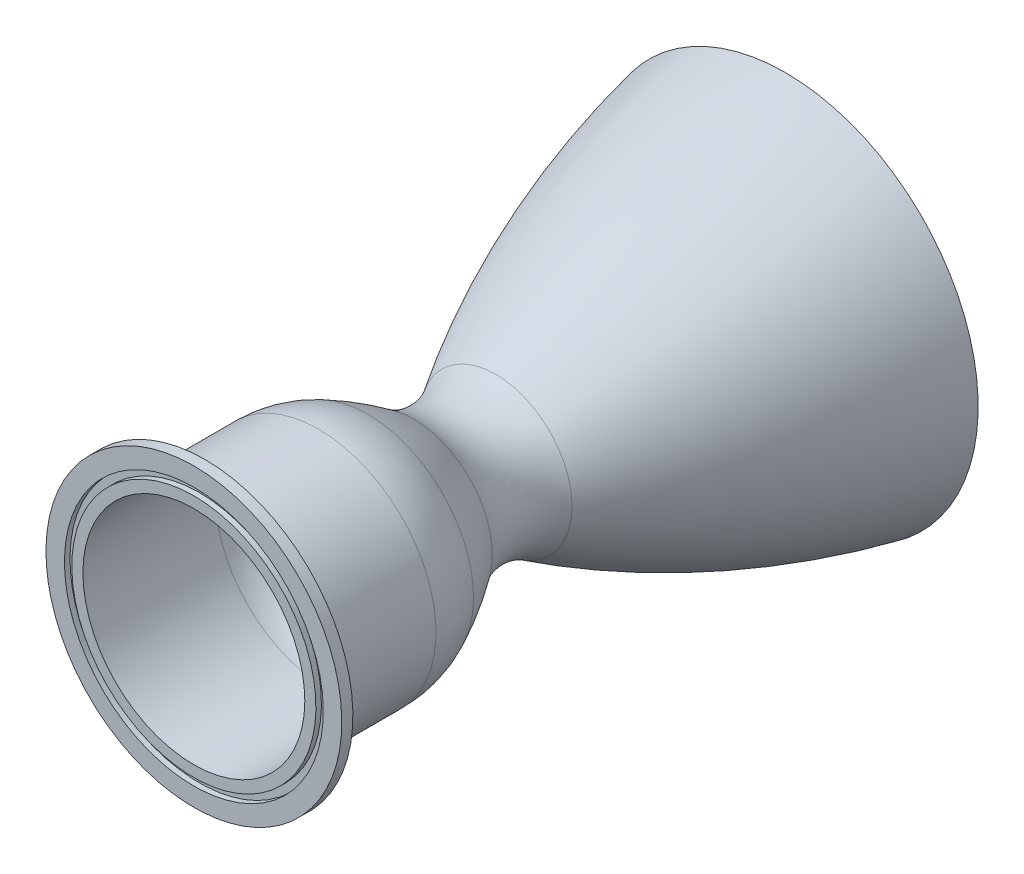
ISO-10303-21;
HEADER;
FILE_DESCRIPTION(('STEP AP214'),'2;1');
FILE_NAME('part.step','',(''),(''),'','','');
FILE_SCHEMA(('AUTOMOTIVE_DESIGN { 1 0 10303 214 1 1 1 1 }'));
ENDSEC;
DATA;
#1=APPLICATION_CONTEXT('core data for automotive mechanical design processes');
#2=APPLICATION_PROTOCOL_DEFINITION('international standard','automotive_design',2000,#1);
#3=PRODUCT_CONTEXT('',#1,'mechanical');
#4=PRODUCT('Part','Part','',(#3));
#5=PRODUCT_RELATED_PRODUCT_CATEGORY('part','',(#4));
#6=PRODUCT_DEFINITION_FORMATION('','',#4);
#7=PRODUCT_DEFINITION_CONTEXT('part definition',#1,'design');
#8=PRODUCT_DEFINITION('design','',#6,#7);
#9=PRODUCT_DEFINITION_SHAPE('','',#8);
#10=(LENGTH_UNIT() NAMED_UNIT(*) SI_UNIT(.MILLI.,.METRE.));
#11=(NAMED_UNIT(*) PLANE_ANGLE_UNIT() SI_UNIT($,.RADIAN.));
#12=(NAMED_UNIT(*) SI_UNIT($,.STERADIAN.) SOLID_ANGLE_UNIT());
#13=UNCERTAINTY_MEASURE_WITH_UNIT(LENGTH_MEASURE(1.E-05),#10,'distance_accuracy_value','');
#14=(GEOMETRIC_REPRESENTATION_CONTEXT(3) GLOBAL_UNCERTAINTY_ASSIGNED_CONTEXT((#13)) GLOBAL_UNIT_ASSIGNED_CONTEXT((#10,
#11,#12)) REPRESENTATION_CONTEXT('',''));
#15=CARTESIAN_POINT('',(0.,0.,0.));
#16=DIRECTION('',(0.,0.,1.));
#17=DIRECTION('',(1.,0.,0.));
#18=AXIS2_PLACEMENT_3D('',#15,#16,#17);
#19=CARTESIAN_POINT('',(0.,51.0189205304801,-160.));
#20=DIRECTION('',(0.,0.,-1.));
#21=DIRECTION('',(-1.,0.,0.));
#22=AXIS2_PLACEMENT_3D('',#19,#20,#21);
#23=PLANE('',#22);
#24=CARTESIAN_POINT('',(0.,0.,-160.));
#25=DIRECTION('',(0.,0.,-1.));
#26=DIRECTION('',(1.,0.,0.));
#27=AXIS2_PLACEMENT_3D('',#24,#25,#26);
#28=CIRCLE('',#27,51.0189205304801);
#29=CARTESIAN_POINT('',(0.,51.0189205304801,-160.));
#30=VERTEX_POINT('',#29);
#31=EDGE_CURVE('E121',#30,#30,#28,.T.);
#32=ORIENTED_EDGE('',*,*,#31,.F.);
#33=EDGE_LOOP('',(#32));
#34=FACE_BOUND('',#33,.T.);
#35=CARTESIAN_POINT('',(0.,0.,-160.));
#36=DIRECTION('',(0.,0.,-1.));
#37=DIRECTION('',(1.,0.,0.));
#38=AXIS2_PLACEMENT_3D('',#35,#36,#37);
#39=CIRCLE('',#38,52.1415043281534);
#40=CARTESIAN_POINT('',(0.,52.1415043281534,-160.));
#41=VERTEX_POINT('',#40);
#42=EDGE_CURVE('E129',#41,#41,#39,.T.);
#43=ORIENTED_EDGE('',*,*,#42,.T.);
#44=EDGE_LOOP('',(#43));
#45=FACE_BOUND('',#44,.T.);
#46=ADVANCED_FACE('F44',(#34,#45),#23,.T.);
#47=CARTESIAN_POINT('',(0.,31.75,-3.));
#48=DIRECTION('',(0.,0.,-1.));
#49=DIRECTION('',(-1.,0.,0.));
#50=AXIS2_PLACEMENT_3D('',#47,#48,#49);
#51=PLANE('',#50);
#52=CARTESIAN_POINT('',(0.,0.,-3.));
#53=DIRECTION('',(0.,0.,-1.));
#54=DIRECTION('',(1.,0.,0.));
#55=AXIS2_PLACEMENT_3D('',#52,#53,#54);
#56=CIRCLE('',#55,31.75);
#57=CARTESIAN_POINT('',(0.,31.75,-3.));
#58=VERTEX_POINT('',#57);
#59=EDGE_CURVE('E133',#58,#58,#56,.T.);
#60=ORIENTED_EDGE('',*,*,#59,.F.);
#61=EDGE_LOOP('',(#60));
#62=FACE_BOUND('',#61,.T.);
#63=CARTESIAN_POINT('',(0.,0.,-3.));
#64=DIRECTION('',(0.,0.,-1.));
#65=DIRECTION('',(1.,0.,0.));
#66=AXIS2_PLACEMENT_3D('',#63,#64,#65);
#67=CIRCLE('',#66,40.0084847717904);
#68=CARTESIAN_POINT('',(0.,40.0084847717904,-3.));
#69=VERTEX_POINT('',#68);
#70=EDGE_CURVE('E11',#69,#69,#67,.T.);
#71=ORIENTED_EDGE('',*,*,#70,.T.);
#72=EDGE_LOOP('',(#71));
#73=FACE_BOUND('',#72,.T.);
#74=ADVANCED_FACE('F162',(#62,#73),#51,.T.);
#75=CARTESIAN_POINT('',(0.,0.,-1.5));
#76=DIRECTION('',(0.,0.,-1.));
#77=DIRECTION('',(0.,1.,0.));
#78=AXIS2_PLACEMENT_3D('',#75,#76,#77);
#79=CYLINDRICAL_SURFACE('',#78,40.0084847717904);
#80=CARTESIAN_POINT('',(0.,0.,0.));
#81=DIRECTION('',(0.,0.,-1.));
#82=DIRECTION('',(1.,0.,0.));
#83=AXIS2_PLACEMENT_3D('',#80,#81,#82);
#84=CIRCLE('',#83,40.0084847717904);
#85=CARTESIAN_POINT('',(0.,40.0084847717904,0.));
#86=VERTEX_POINT('',#85);
#87=EDGE_CURVE('E51',#86,#86,#84,.T.);
#88=ORIENTED_EDGE('',*,*,#87,.T.);
#89=EDGE_LOOP('',(#88));
#90=FACE_BOUND('',#89,.T.);
#91=ORIENTED_EDGE('',*,*,#70,.F.);
#92=EDGE_LOOP('',(#91));
#93=FACE_BOUND('',#92,.T.);
#94=ADVANCED_FACE('F159',(#90,#93),#79,.T.);
#95=CARTESIAN_POINT('',(0.,40.0084847717904,0.));
#96=DIRECTION('',(0.,0.,1.));
#97=DIRECTION('',(1.,0.,0.));
#98=AXIS2_PLACEMENT_3D('',#95,#96,#97);
#99=PLANE('',#98);
#100=CARTESIAN_POINT('',(0.,0.,0.));
#101=DIRECTION('',(0.,0.,-1.));
#102=DIRECTION('',(1.,0.,0.));
#103=AXIS2_PLACEMENT_3D('',#100,#101,#102);
#104=CIRCLE('',#103,35.0084847717904);
#105=CARTESIAN_POINT('',(0.,35.0084847717904,0.));
#106=VERTEX_POINT('',#105);
#107=EDGE_CURVE('E141',#106,#106,#104,.T.);
#108=ORIENTED_EDGE('',*,*,#107,.T.);
#109=EDGE_LOOP('',(#108));
#110=FACE_BOUND('',#109,.T.);
#111=ORIENTED_EDGE('',*,*,#87,.F.);
#112=EDGE_LOOP('',(#111));
#113=FACE_BOUND('',#112,.T.);
#114=ADVANCED_FACE('F144',(#110,#113),#99,.T.);
#115=CARTESIAN_POINT('',(0.,0.,-0.75));
#116=DIRECTION('',(0.,0.,1.));
#117=DIRECTION('',(0.,1.,0.));
#118=AXIS2_PLACEMENT_3D('',#115,#116,#117);
#119=CYLINDRICAL_SURFACE('',#118,35.0084847717904);
#120=CARTESIAN_POINT('',(0.,0.,-1.5));
#121=DIRECTION('',(0.,0.,-1.));
#122=DIRECTION('',(1.,0.,0.));
#123=AXIS2_PLACEMENT_3D('',#120,#121,#122);
#124=CIRCLE('',#123,35.0084847717904);
#125=CARTESIAN_POINT('',(0.,35.0084847717904,-1.5));
#126=VERTEX_POINT('',#125);
#127=EDGE_CURVE('E139',#126,#126,#124,.T.);
#128=ORIENTED_EDGE('',*,*,#127,.T.);
#129=EDGE_LOOP('',(#128));
#130=FACE_BOUND('',#129,.T.);
#131=ORIENTED_EDGE('',*,*,#107,.F.);
#132=EDGE_LOOP('',(#131));
#133=FACE_BOUND('',#132,.T.);
#134=ADVANCED_FACE('F147',(#130,#133),#119,.F.);
#135=CARTESIAN_POINT('',(0.,35.0084847717904,-1.5));
#136=DIRECTION('',(0.,0.,1.));
#137=DIRECTION('',(1.,0.,0.));
#138=AXIS2_PLACEMENT_3D('',#135,#136,#137);
#139=PLANE('',#138);
#140=CARTESIAN_POINT('',(0.,0.,-1.5));
#141=DIRECTION('',(0.,0.,-1.));
#142=DIRECTION('',(1.,0.,0.));
#143=AXIS2_PLACEMENT_3D('',#140,#141,#142);
#144=CIRCLE('',#143,33.0084847717904);
#145=CARTESIAN_POINT('',(0.,33.0084847717904,-1.5));
#146=VERTEX_POINT('',#145);
#147=EDGE_CURVE('E137',#146,#146,#144,.T.);
#148=ORIENTED_EDGE('',*,*,#147,.T.);
#149=EDGE_LOOP('',(#148));
#150=FACE_BOUND('',#149,.T.);
#151=ORIENTED_EDGE('',*,*,#127,.F.);
#152=EDGE_LOOP('',(#151));
#153=FACE_BOUND('',#152,.T.);
#154=ADVANCED_FACE('F149',(#150,#153),#139,.T.);
#155=CARTESIAN_POINT('',(0.,0.,-0.75));
#156=DIRECTION('',(0.,0.,-1.));
#157=DIRECTION('',(0.,1.,0.));
#158=AXIS2_PLACEMENT_3D('',#155,#156,#157);
#159=CYLINDRICAL_SURFACE('',#158,33.0084847717904);
#160=CARTESIAN_POINT('',(0.,0.,0.));
#161=DIRECTION('',(0.,0.,-1.));
#162=DIRECTION('',(1.,0.,0.));
#163=AXIS2_PLACEMENT_3D('',#160,#161,#162);
#164=CIRCLE('',#163,33.0084847717904);
#165=CARTESIAN_POINT('',(0.,33.0084847717904,0.));
#166=VERTEX_POINT('',#165);
#167=EDGE_CURVE('E135',#166,#166,#164,.T.);
#168=ORIENTED_EDGE('',*,*,#167,.T.);
#169=EDGE_LOOP('',(#168));
#170=FACE_BOUND('',#169,.T.);
#171=ORIENTED_EDGE('',*,*,#147,.F.);
#172=EDGE_LOOP('',(#171));
#173=FACE_BOUND('',#172,.T.);
#174=ADVANCED_FACE('F156',(#170,#173),#159,.T.);
#175=CARTESIAN_POINT('',(0.,33.0084847717904,0.));
#176=DIRECTION('',(0.,0.,1.));
#177=DIRECTION('',(1.,0.,0.));
#178=AXIS2_PLACEMENT_3D('',#175,#176,#177);
#179=PLANE('',#178);
#180=CARTESIAN_POINT('',(0.,0.,0.));
#181=DIRECTION('',(0.,0.,-1.));
#182=DIRECTION('',(1.,0.,0.));
#183=AXIS2_PLACEMENT_3D('',#180,#181,#182);
#184=CIRCLE('',#183,30.0084847717904);
#185=CARTESIAN_POINT('',(0.,30.0084847717904,0.));
#186=VERTEX_POINT('',#185);
#187=EDGE_CURVE('E117',#186,#186,#184,.T.);
#188=ORIENTED_EDGE('',*,*,#187,.T.);
#189=EDGE_LOOP('',(#188));
#190=FACE_BOUND('',#189,.T.);
#191=ORIENTED_EDGE('',*,*,#167,.F.);
#192=EDGE_LOOP('',(#191));
#193=FACE_BOUND('',#192,.T.);
#194=ADVANCED_FACE('F193',(#190,#193),#179,.T.);
#195=CARTESIAN_POINT('',(0.,0.,-21.5));
#196=DIRECTION('',(0.,0.,-1.));
#197=DIRECTION('',(0.,1.,0.));
#198=AXIS2_PLACEMENT_3D('',#195,#196,#197);
#199=CYLINDRICAL_SURFACE('',#198,31.75);
#200=CARTESIAN_POINT('',(0.,0.,-33.7351958082016));
#201=DIRECTION('',(0.,0.,-1.));
#202=DIRECTION('',(0.,-1.,0.));
#203=AXIS2_PLACEMENT_3D('',#200,#201,#202);
#204=CIRCLE('',#203,31.75);
#205=CARTESIAN_POINT('',(0.,31.75,-33.7351958082016));
#206=VERTEX_POINT('',#205);
#207=EDGE_CURVE('E131',#206,#206,#204,.T.);
#208=ORIENTED_EDGE('',*,*,#207,.F.);
#209=EDGE_LOOP('',(#208));
#210=FACE_BOUND('',#209,.T.);
#211=ORIENTED_EDGE('',*,*,#59,.T.);
#212=EDGE_LOOP('',(#211));
#213=FACE_BOUND('',#212,.T.);
#214=ADVANCED_FACE('F185',(#210,#213),#199,.T.);
#215=CARTESIAN_POINT('',(0.,0.,-33.7351958082016));
#216=DIRECTION('',(0.,0.,-1.));
#217=DIRECTION('',(-1.,0.,0.));
#218=AXIS2_PLACEMENT_3D('',#215,#216,#217);
#219=DEGENERATE_TOROIDAL_SURFACE('',#218,1.75,30.,.T.);
#220=CARTESIAN_POINT('',(0.,0.,-46.9815567864602));
#221=DIRECTION('',(0.,0.,1.));
#222=DIRECTION('',(0.,-1.,0.));
#223=AXIS2_PLACEMENT_3D('',#220,#221,#222);
#224=CIRCLE('',#223,28.6671677713995);
#225=CARTESIAN_POINT('',(0.,28.6671677713995,-46.9815567864602));
#226=VERTEX_POINT('',#225);
#227=EDGE_CURVE('E127',#226,#226,#224,.T.);
#228=ORIENTED_EDGE('',*,*,#227,.T.);
#229=EDGE_LOOP('',(#228));
#230=FACE_BOUND('',#229,.T.);
#231=ORIENTED_EDGE('',*,*,#207,.T.);
#232=EDGE_LOOP('',(#231));
#233=FACE_BOUND('',#232,.T.);
#234=ADVANCED_FACE('F175',(#230,#233),#219,.T.);
#235=CARTESIAN_POINT('',(0.,0.,-208.671046048929));
#236=DIRECTION('',(0.,0.,-1.));
#237=DIRECTION('',(-1.,0.,0.));
#238=AXIS2_PLACEMENT_3D('',#235,#236,#237);
#239=DEGENERATE_TOROIDAL_SURFACE('',#238,181.851147330347,239.000903248655,.F.);
#240=CARTESIAN_POINT('',(0.,0.,-81.6684638668013));
#241=DIRECTION('',(0.,0.,1.));
#242=DIRECTION('',(0.,-1.,0.));
#243=AXIS2_PLACEMENT_3D('',#240,#241,#242);
#244=CIRCLE('',#243,20.6131109295868);
#245=CARTESIAN_POINT('',(0.,20.6131109295868,-81.6684638668013));
#246=VERTEX_POINT('',#245);
#247=EDGE_CURVE('E125',#246,#246,#244,.T.);
#248=ORIENTED_EDGE('',*,*,#247,.F.);
#249=EDGE_LOOP('',(#248));
#250=FACE_BOUND('',#249,.T.);
#251=ORIENTED_EDGE('',*,*,#42,.F.);
#252=EDGE_LOOP('',(#251));
#253=FACE_BOUND('',#252,.T.);
#254=ADVANCED_FACE('F172',(#250,#253),#239,.F.);
#255=CARTESIAN_POINT('',(0.,0.,-6.36998999925671));
#256=DIRECTION('',(0.,0.,-1.));
#257=DIRECTION('',(-1.,0.,0.));
#258=AXIS2_PLACEMENT_3D('',#255,#256,#257);
#259=DEGENERATE_TOROIDAL_SURFACE('',#258,53.8572597649441,91.9759778263472,.F.);
#260=CARTESIAN_POINT('',(0.,0.,-59.4898591960974));
#261=DIRECTION('',(0.,0.,-1.));
#262=DIRECTION('',(0.,-1.,0.));
#263=AXIS2_PLACEMENT_3D('',#260,#261,#262);
#264=CIRCLE('',#263,21.2284245804972);
#265=CARTESIAN_POINT('',(0.,21.2284245804972,-59.4898591960974));
#266=VERTEX_POINT('',#265);
#267=EDGE_CURVE('E123',#266,#266,#264,.T.);
#268=ORIENTED_EDGE('',*,*,#267,.F.);
#269=EDGE_LOOP('',(#268));
#270=FACE_BOUND('',#269,.T.);
#271=ORIENTED_EDGE('',*,*,#227,.F.);
#272=EDGE_LOOP('',(#271));
#273=FACE_BOUND('',#272,.T.);
#274=ADVANCED_FACE('F174',(#270,#273),#259,.F.);
#275=CARTESIAN_POINT('',(0.,0.,-71.040672887284));
#276=DIRECTION('',(0.,0.,1.));
#277=DIRECTION('',(-1.,0.,0.));
#278=AXIS2_PLACEMENT_3D('',#275,#276,#277);
#279=TOROIDAL_SURFACE('',#278,37.5556626528571,20.);
#280=ORIENTED_EDGE('',*,*,#247,.T.);
#281=EDGE_LOOP('',(#280));
#282=FACE_BOUND('',#281,.T.);
#283=ORIENTED_EDGE('',*,*,#267,.T.);
#284=EDGE_LOOP('',(#283));
#285=FACE_BOUND('',#284,.T.);
#286=ADVANCED_FACE('F182',(#282,#285),#279,.F.);
#287=CARTESIAN_POINT('',(0.,0.,-202.93944338944));
#288=DIRECTION('',(0.,0.,1.));
#289=DIRECTION('',(-1.,0.,0.));
#290=AXIS2_PLACEMENT_3D('',#287,#288,#289);
#291=DEGENERATE_TOROIDAL_SURFACE('',#290,162.439301006246,217.73426037309,.F.);
#292=CARTESIAN_POINT('',(0.,0.,-82.1790743869948));
#293=DIRECTION('',(0.,0.,-1.));
#294=DIRECTION('',(0.,-1.,0.));
#295=AXIS2_PLACEMENT_3D('',#292,#293,#294);
#296=CIRCLE('',#295,18.7377985913855);
#297=CARTESIAN_POINT('',(0.,18.7377985913855,-82.1790743869948));
#298=VERTEX_POINT('',#297);
#299=EDGE_CURVE('E119',#298,#298,#296,.T.);
#300=ORIENTED_EDGE('',*,*,#299,.F.);
#301=EDGE_LOOP('',(#300));
#302=FACE_BOUND('',#301,.T.);
#303=ORIENTED_EDGE('',*,*,#31,.T.);
#304=EDGE_LOOP('',(#303));
#305=FACE_BOUND('',#304,.T.);
#306=ADVANCED_FACE('F245',(#302,#305),#291,.T.);
#307=CARTESIAN_POINT('',(0.,0.,-71.0866198696835));
#308=DIRECTION('',(0.,0.,-1.));
#309=DIRECTION('',(-1.,0.,0.));
#310=AXIS2_PLACEMENT_3D('',#307,#308,#309);
#311=TOROIDAL_SURFACE('',#310,35.3798373120886,20.);
#312=CARTESIAN_POINT('',(0.,0.,-59.2662675053221));
#313=DIRECTION('',(0.,0.,1.));
#314=DIRECTION('',(0.,-1.,0.));
#315=AXIS2_PLACEMENT_3D('',#312,#313,#314);
#316=CIRCLE('',#315,19.2466643451136);
#317=CARTESIAN_POINT('',(0.,19.2466643451136,-59.2662675053221));
#318=VERTEX_POINT('',#317);
#319=EDGE_CURVE('E113',#318,#318,#316,.T.);
#320=ORIENTED_EDGE('',*,*,#319,.T.);
#321=EDGE_LOOP('',(#320));
#322=FACE_BOUND('',#321,.T.);
#323=ORIENTED_EDGE('',*,*,#299,.T.);
#324=EDGE_LOOP('',(#323));
#325=FACE_BOUND('',#324,.T.);
#326=ADVANCED_FACE('F255',(#322,#325),#311,.T.);
#327=CARTESIAN_POINT('',(0.,0.,-21.5));
#328=DIRECTION('',(0.,0.,1.));
#329=DIRECTION('',(0.,1.,0.));
#330=AXIS2_PLACEMENT_3D('',#327,#328,#329);
#331=CYLINDRICAL_SURFACE('',#330,30.0084847717904);
#332=CARTESIAN_POINT('',(0.,0.,-35.8298690040139));
#333=DIRECTION('',(0.,0.,1.));
#334=DIRECTION('',(0.,-1.,0.));
#335=AXIS2_PLACEMENT_3D('',#332,#333,#334);
#336=CIRCLE('',#335,30.0084847717904);
#337=CARTESIAN_POINT('',(0.,30.0084847717904,-35.8298690040139));
#338=VERTEX_POINT('',#337);
#339=EDGE_CURVE('E111',#338,#338,#336,.T.);
#340=ORIENTED_EDGE('',*,*,#339,.F.);
#341=EDGE_LOOP('',(#340));
#342=FACE_BOUND('',#341,.T.);
#343=ORIENTED_EDGE('',*,*,#187,.F.);
#344=EDGE_LOOP('',(#343));
#345=FACE_BOUND('',#344,.T.);
#346=ADVANCED_FACE('F266',(#342,#345),#331,.F.);
#347=CARTESIAN_POINT('',(0.,0.,-6.07468186569553));
#348=DIRECTION('',(0.,0.,1.));
#349=DIRECTION('',(-1.,0.,0.));
#350=AXIS2_PLACEMENT_3D('',#347,#348,#349);
#351=DEGENERATE_TOROIDAL_SURFACE('',#350,53.3526140062742,90.,.F.);
#352=CARTESIAN_POINT('',(0.,0.,-44.3313510435335));
#353=DIRECTION('',(0.,0.,-1.));
#354=DIRECTION('',(0.,-1.,0.));
#355=AXIS2_PLACEMENT_3D('',#352,#353,#354);
#356=CIRCLE('',#355,28.1116558512374);
#357=CARTESIAN_POINT('',(0.,28.1116558512374,-44.3313510435335));
#358=VERTEX_POINT('',#357);
#359=EDGE_CURVE('E108',#358,#358,#356,.T.);
#360=ORIENTED_EDGE('',*,*,#359,.F.);
#361=EDGE_LOOP('',(#360));
#362=FACE_BOUND('',#361,.T.);
#363=ORIENTED_EDGE('',*,*,#319,.F.);
#364=EDGE_LOOP('',(#363));
#365=FACE_BOUND('',#364,.T.);
#366=ADVANCED_FACE('F277',(#362,#365),#351,.T.);
#367=CARTESIAN_POINT('',(0.,0.,-35.8298690040139));
#368=DIRECTION('',(0.,0.,1.));
#369=DIRECTION('',(-1.,0.,0.));
#370=AXIS2_PLACEMENT_3D('',#367,#368,#369);
#371=DEGENERATE_TOROIDAL_SURFACE('',#370,10.0084847717904,20.,.T.);
#372=ORIENTED_EDGE('',*,*,#339,.T.);
#373=EDGE_LOOP('',(#372));
#374=FACE_BOUND('',#373,.T.);
#375=ORIENTED_EDGE('',*,*,#359,.T.);
#376=EDGE_LOOP('',(#375));
#377=FACE_BOUND('',#376,.T.);
#378=ADVANCED_FACE('F109',(#374,#377),#371,.F.);
#379=CLOSED_SHELL('',(#46,#74,#94,#114,#134,#154,#174,#194,#214,#234,#254,#274,#286,#306,#326,
#346,#366,#378));
#380=MANIFOLD_SOLID_BREP('B2',#379);
#381=ADVANCED_BREP_SHAPE_REPRESENTATION('',(#18,#380),#14);
#382=SHAPE_DEFINITION_REPRESENTATION(#9,#381);
ENDSEC;
END-ISO-10303-21;
